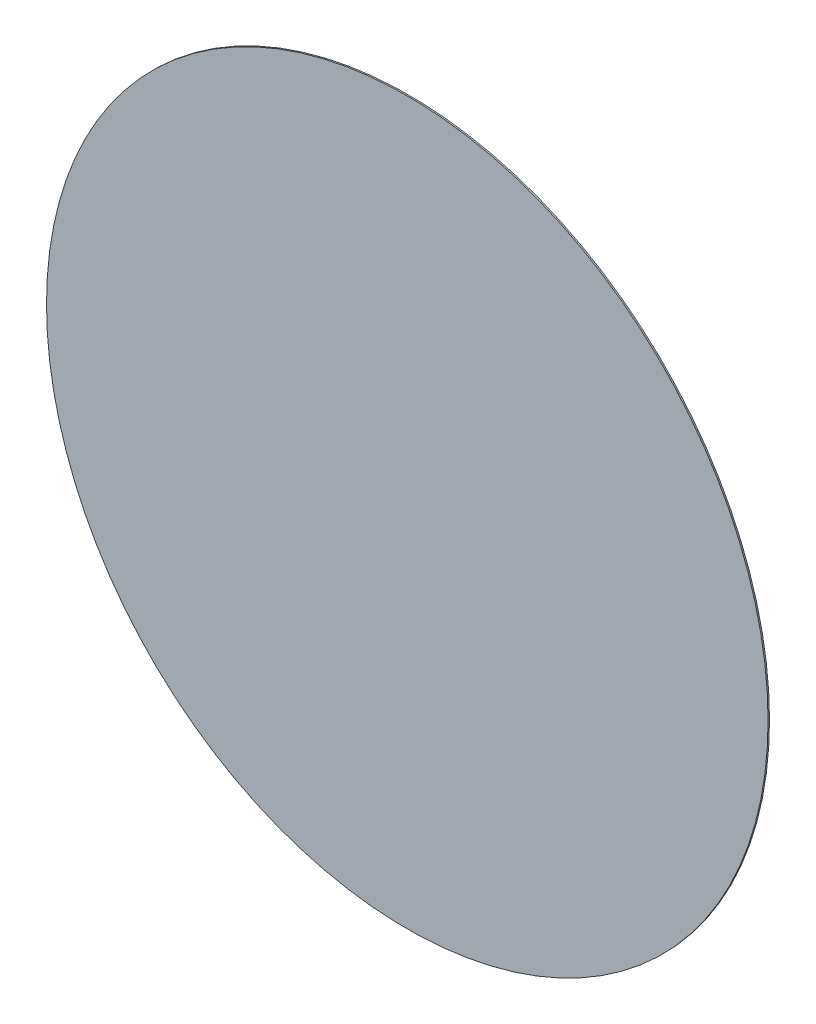
ISO-10303-21;
HEADER;
FILE_DESCRIPTION(('STEP AP214'),'2;1');
FILE_NAME('part.step','',(''),(''),'','','');
FILE_SCHEMA(('AUTOMOTIVE_DESIGN { 1 0 10303 214 1 1 1 1 }'));
ENDSEC;
DATA;
#1=APPLICATION_CONTEXT('core data for automotive mechanical design processes');
#2=APPLICATION_PROTOCOL_DEFINITION('international standard','automotive_design',2000,#1);
#3=PRODUCT_CONTEXT('',#1,'mechanical');
#4=PRODUCT('Part','Part','',(#3));
#5=PRODUCT_RELATED_PRODUCT_CATEGORY('part','',(#4));
#6=PRODUCT_DEFINITION_FORMATION('','',#4);
#7=PRODUCT_DEFINITION_CONTEXT('part definition',#1,'design');
#8=PRODUCT_DEFINITION('design','',#6,#7);
#9=PRODUCT_DEFINITION_SHAPE('','',#8);
#10=(LENGTH_UNIT() NAMED_UNIT(*) SI_UNIT(.MILLI.,.METRE.));
#11=(NAMED_UNIT(*) PLANE_ANGLE_UNIT() SI_UNIT($,.RADIAN.));
#12=(NAMED_UNIT(*) SI_UNIT($,.STERADIAN.) SOLID_ANGLE_UNIT());
#13=UNCERTAINTY_MEASURE_WITH_UNIT(LENGTH_MEASURE(1.E-05),#10,'distance_accuracy_value','');
#14=(GEOMETRIC_REPRESENTATION_CONTEXT(3) GLOBAL_UNCERTAINTY_ASSIGNED_CONTEXT((#13)) GLOBAL_UNIT_ASSIGNED_CONTEXT((#10,
#11,#12)) REPRESENTATION_CONTEXT('',''));
#15=CARTESIAN_POINT('',(0.,0.,0.));
#16=DIRECTION('',(0.,0.,1.));
#17=DIRECTION('',(1.,0.,0.));
#18=AXIS2_PLACEMENT_3D('',#15,#16,#17);
#19=CARTESIAN_POINT('',(0.,0.,0.5));
#20=DIRECTION('',(0.,0.,-1.));
#21=DIRECTION('',(-1.,0.,0.));
#22=AXIS2_PLACEMENT_3D('',#19,#20,#21);
#23=CYLINDRICAL_SURFACE('',#22,127.);
#24=CARTESIAN_POINT('',(0.,0.,0.5));
#25=DIRECTION('',(0.,0.,1.));
#26=DIRECTION('',(1.,0.,0.));
#27=AXIS2_PLACEMENT_3D('',#24,#25,#26);
#28=CIRCLE('',#27,127.);
#29=CARTESIAN_POINT('',(127.,0.,0.5));
#30=VERTEX_POINT('',#29);
#31=EDGE_CURVE('E10',#30,#30,#28,.T.);
#32=ORIENTED_EDGE('',*,*,#31,.F.);
#33=EDGE_LOOP('',(#32));
#34=FACE_BOUND('',#33,.T.);
#35=CARTESIAN_POINT('',(0.,0.,0.));
#36=DIRECTION('',(0.,0.,1.));
#37=DIRECTION('',(1.,0.,0.));
#38=AXIS2_PLACEMENT_3D('',#35,#36,#37);
#39=CIRCLE('',#38,127.);
#40=CARTESIAN_POINT('',(127.,0.,0.));
#41=VERTEX_POINT('',#40);
#42=EDGE_CURVE('E34',#41,#41,#39,.T.);
#43=ORIENTED_EDGE('',*,*,#42,.T.);
#44=EDGE_LOOP('',(#43));
#45=FACE_BOUND('',#44,.T.);
#46=ADVANCED_FACE('F31',(#34,#45),#23,.T.);
#47=CARTESIAN_POINT('',(0.,0.,0.5));
#48=DIRECTION('',(0.,0.,1.));
#49=DIRECTION('',(1.,0.,0.));
#50=AXIS2_PLACEMENT_3D('',#47,#48,#49);
#51=PLANE('',#50);
#52=ORIENTED_EDGE('',*,*,#31,.T.);
#53=EDGE_LOOP('',(#52));
#54=FACE_BOUND('',#53,.T.);
#55=ADVANCED_FACE('F46',(#54),#51,.T.);
#56=CARTESIAN_POINT('',(0.,0.,0.));
#57=DIRECTION('',(0.,0.,1.));
#58=DIRECTION('',(1.,0.,0.));
#59=AXIS2_PLACEMENT_3D('',#56,#57,#58);
#60=PLANE('',#59);
#61=ORIENTED_EDGE('',*,*,#42,.F.);
#62=EDGE_LOOP('',(#61));
#63=FACE_BOUND('',#62,.T.);
#64=ADVANCED_FACE('F44',(#63),#60,.F.);
#65=CLOSED_SHELL('',(#46,#55,#64));
#66=MANIFOLD_SOLID_BREP('B2',#65);
#67=ADVANCED_BREP_SHAPE_REPRESENTATION('',(#18,#66),#14);
#68=SHAPE_DEFINITION_REPRESENTATION(#9,#67);
ENDSEC;
END-ISO-10303-21;
